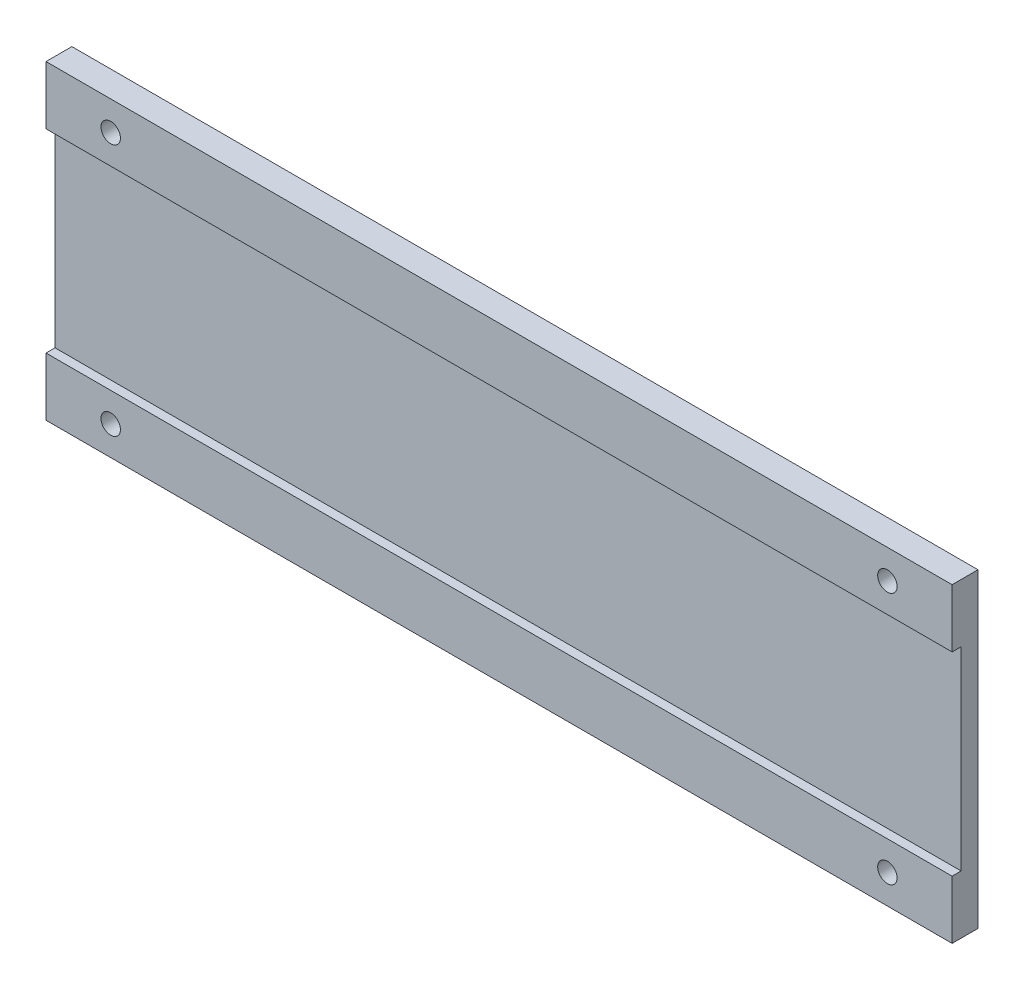
ISO-10303-21;
HEADER;
FILE_DESCRIPTION(('STEP AP214'),'2;1');
FILE_NAME('part.step','',(''),(''),'','','');
FILE_SCHEMA(('AUTOMOTIVE_DESIGN { 1 0 10303 214 1 1 1 1 }'));
ENDSEC;
DATA;
#1=APPLICATION_CONTEXT('core data for automotive mechanical design processes');
#2=APPLICATION_PROTOCOL_DEFINITION('international standard','automotive_design',2000,#1);
#3=PRODUCT_CONTEXT('',#1,'mechanical');
#4=PRODUCT('Part','Part','',(#3));
#5=PRODUCT_RELATED_PRODUCT_CATEGORY('part','',(#4));
#6=PRODUCT_DEFINITION_FORMATION('','',#4);
#7=PRODUCT_DEFINITION_CONTEXT('part definition',#1,'design');
#8=PRODUCT_DEFINITION('design','',#6,#7);
#9=PRODUCT_DEFINITION_SHAPE('','',#8);
#10=(LENGTH_UNIT() NAMED_UNIT(*) SI_UNIT(.MILLI.,.METRE.));
#11=(NAMED_UNIT(*) PLANE_ANGLE_UNIT() SI_UNIT($,.RADIAN.));
#12=(NAMED_UNIT(*) SI_UNIT($,.STERADIAN.) SOLID_ANGLE_UNIT());
#13=UNCERTAINTY_MEASURE_WITH_UNIT(LENGTH_MEASURE(1.E-05),#10,'distance_accuracy_value','');
#14=(GEOMETRIC_REPRESENTATION_CONTEXT(3) GLOBAL_UNCERTAINTY_ASSIGNED_CONTEXT((#13)) GLOBAL_UNIT_ASSIGNED_CONTEXT((#10,
#11,#12)) REPRESENTATION_CONTEXT('',''));
#15=CARTESIAN_POINT('',(0.,0.,0.));
#16=DIRECTION('',(0.,0.,1.));
#17=DIRECTION('',(1.,0.,0.));
#18=AXIS2_PLACEMENT_3D('',#15,#16,#17);
#19=CARTESIAN_POINT('',(0.,0.,4.));
#20=DIRECTION('',(0.,0.,1.));
#21=DIRECTION('',(1.,0.,0.));
#22=AXIS2_PLACEMENT_3D('',#19,#20,#21);
#23=PLANE('',#22);
#24=CARTESIAN_POINT('',(96.4410415455192,-17.5606060606061,4.));
#25=DIRECTION('',(0.,0.,1.));
#26=DIRECTION('',(1.,0.,0.));
#27=AXIS2_PLACEMENT_3D('',#24,#25,#26);
#28=CIRCLE('',#27,1.5);
#29=CARTESIAN_POINT('',(97.9410415455192,-17.5606060606061,4.));
#30=VERTEX_POINT('',#29);
#31=EDGE_CURVE('E186',#30,#30,#28,.T.);
#32=ORIENTED_EDGE('',*,*,#31,.F.);
#33=EDGE_LOOP('',(#32));
#34=FACE_BOUND('',#33,.T.);
#35=CARTESIAN_POINT('',(-23.5589584544808,-17.5606060606061,4.));
#36=DIRECTION('',(0.,0.,1.));
#37=DIRECTION('',(1.,0.,0.));
#38=AXIS2_PLACEMENT_3D('',#35,#36,#37);
#39=CIRCLE('',#38,1.5);
#40=CARTESIAN_POINT('',(-22.0589584544808,-17.5606060606061,4.));
#41=VERTEX_POINT('',#40);
#42=EDGE_CURVE('E177',#41,#41,#39,.T.);
#43=ORIENTED_EDGE('',*,*,#42,.F.);
#44=EDGE_LOOP('',(#43));
#45=FACE_BOUND('',#44,.T.);
#46=DIRECTION('',(-1.,0.,0.));
#47=VECTOR('',#46,1.);
#48=CARTESIAN_POINT('',(106.441041545519,-13.0606060606061,4.));
#49=LINE('',#48,#47);
#50=CARTESIAN_POINT('',(106.441041545519,-13.0606060606061,4.));
#51=VERTEX_POINT('',#50);
#52=CARTESIAN_POINT('',(-33.5589584544808,-13.0606060606061,4.));
#53=VERTEX_POINT('',#52);
#54=EDGE_CURVE('E144',#51,#53,#49,.T.);
#55=ORIENTED_EDGE('',*,*,#54,.T.);
#56=DIRECTION('',(0.,-1.,0.));
#57=VECTOR('',#56,1.);
#58=CARTESIAN_POINT('',(-33.5589584544808,25.9393939393939,4.));
#59=LINE('',#58,#57);
#60=CARTESIAN_POINT('',(-33.5589584544808,-22.0606060606061,4.));
#61=VERTEX_POINT('',#60);
#62=EDGE_CURVE('E88',#53,#61,#59,.T.);
#63=ORIENTED_EDGE('',*,*,#62,.T.);
#64=DIRECTION('',(1.,0.,0.));
#65=VECTOR('',#64,1.);
#66=CARTESIAN_POINT('',(-33.5589584544808,-22.0606060606061,4.));
#67=LINE('',#66,#65);
#68=CARTESIAN_POINT('',(106.441041545519,-22.0606060606061,4.));
#69=VERTEX_POINT('',#68);
#70=EDGE_CURVE('E151',#61,#69,#67,.T.);
#71=ORIENTED_EDGE('',*,*,#70,.T.);
#72=DIRECTION('',(0.,1.,0.));
#73=VECTOR('',#72,1.);
#74=CARTESIAN_POINT('',(106.441041545519,25.9393939393939,4.));
#75=LINE('',#74,#73);
#76=EDGE_CURVE('E153',#69,#51,#75,.T.);
#77=ORIENTED_EDGE('',*,*,#76,.T.);
#78=EDGE_LOOP('',(#55,#63,#71,#77));
#79=FACE_BOUND('',#78,.T.);
#80=ADVANCED_FACE('F33',(#34,#45,#79),#23,.T.);
#81=CARTESIAN_POINT('',(-33.5589584544808,25.9393939393939,4.));
#82=DIRECTION('',(1.,0.,0.));
#83=DIRECTION('',(0.,0.,-1.));
#84=AXIS2_PLACEMENT_3D('',#81,#82,#83);
#85=PLANE('',#84);
#86=ORIENTED_EDGE('',*,*,#62,.F.);
#87=DIRECTION('',(0.,0.,1.));
#88=VECTOR('',#87,1.);
#89=CARTESIAN_POINT('',(-33.5589584544808,-13.0606060606061,4.));
#90=LINE('',#89,#88);
#91=CARTESIAN_POINT('',(-33.5589584544808,-13.0606060606061,2.60987779067783));
#92=VERTEX_POINT('',#91);
#93=EDGE_CURVE('E132',#92,#53,#90,.T.);
#94=ORIENTED_EDGE('',*,*,#93,.F.);
#95=DIRECTION('',(0.,-1.,0.));
#96=VECTOR('',#95,1.);
#97=CARTESIAN_POINT('',(-33.5589584544808,16.9393939393939,2.60987779067783));
#98=LINE('',#97,#96);
#99=CARTESIAN_POINT('',(-33.5589584544808,16.9393939393939,2.60987779067783));
#100=VERTEX_POINT('',#99);
#101=EDGE_CURVE('E134',#100,#92,#98,.T.);
#102=ORIENTED_EDGE('',*,*,#101,.F.);
#103=DIRECTION('',(0.,0.,-1.));
#104=VECTOR('',#103,1.);
#105=CARTESIAN_POINT('',(-33.5589584544808,16.9393939393939,4.));
#106=LINE('',#105,#104);
#107=CARTESIAN_POINT('',(-33.5589584544808,16.9393939393939,4.));
#108=VERTEX_POINT('',#107);
#109=EDGE_CURVE('E113',#108,#100,#106,.T.);
#110=ORIENTED_EDGE('',*,*,#109,.F.);
#111=CARTESIAN_POINT('',(-33.5589584544808,25.9393939393939,4.));
#112=VERTEX_POINT('',#111);
#113=EDGE_CURVE('E149',#112,#108,#59,.T.);
#114=ORIENTED_EDGE('',*,*,#113,.F.);
#115=DIRECTION('',(0.,0.,-1.));
#116=VECTOR('',#115,1.);
#117=CARTESIAN_POINT('',(-33.5589584544808,25.9393939393939,4.));
#118=LINE('',#117,#116);
#119=CARTESIAN_POINT('',(-33.5589584544808,25.9393939393939,0.));
#120=VERTEX_POINT('',#119);
#121=EDGE_CURVE('E157',#112,#120,#118,.T.);
#122=ORIENTED_EDGE('',*,*,#121,.T.);
#123=DIRECTION('',(0.,-1.,0.));
#124=VECTOR('',#123,1.);
#125=CARTESIAN_POINT('',(-33.5589584544808,25.9393939393939,0.));
#126=LINE('',#125,#124);
#127=CARTESIAN_POINT('',(-33.5589584544808,-22.0606060606061,0.));
#128=VERTEX_POINT('',#127);
#129=EDGE_CURVE('E146',#120,#128,#126,.T.);
#130=ORIENTED_EDGE('',*,*,#129,.T.);
#131=DIRECTION('',(0.,0.,-1.));
#132=VECTOR('',#131,1.);
#133=CARTESIAN_POINT('',(-33.5589584544808,-22.0606060606061,4.));
#134=LINE('',#133,#132);
#135=EDGE_CURVE('E11',#61,#128,#134,.T.);
#136=ORIENTED_EDGE('',*,*,#135,.F.);
#137=EDGE_LOOP('',(#86,#94,#102,#110,#114,#122,#130,#136));
#138=FACE_BOUND('',#137,.T.);
#139=ADVANCED_FACE('F35',(#138),#85,.F.);
#140=CARTESIAN_POINT('',(-33.5589584544808,-22.0606060606061,4.));
#141=DIRECTION('',(0.,1.,0.));
#142=DIRECTION('',(-1.,0.,0.));
#143=AXIS2_PLACEMENT_3D('',#140,#141,#142);
#144=PLANE('',#143);
#145=DIRECTION('',(1.,0.,0.));
#146=VECTOR('',#145,1.);
#147=CARTESIAN_POINT('',(-33.5589584544808,-22.0606060606061,0.));
#148=LINE('',#147,#146);
#149=CARTESIAN_POINT('',(106.441041545519,-22.0606060606061,0.));
#150=VERTEX_POINT('',#149);
#151=EDGE_CURVE('E160',#128,#150,#148,.T.);
#152=ORIENTED_EDGE('',*,*,#151,.T.);
#153=DIRECTION('',(0.,0.,-1.));
#154=VECTOR('',#153,1.);
#155=CARTESIAN_POINT('',(106.441041545519,-22.0606060606061,4.));
#156=LINE('',#155,#154);
#157=EDGE_CURVE('E42',#69,#150,#156,.T.);
#158=ORIENTED_EDGE('',*,*,#157,.F.);
#159=ORIENTED_EDGE('',*,*,#70,.F.);
#160=ORIENTED_EDGE('',*,*,#135,.T.);
#161=EDGE_LOOP('',(#152,#158,#159,#160));
#162=FACE_BOUND('',#161,.T.);
#163=ADVANCED_FACE('F205',(#162),#144,.F.);
#164=CARTESIAN_POINT('',(106.441041545519,25.9393939393939,4.));
#165=DIRECTION('',(-1.,0.,0.));
#166=DIRECTION('',(0.,0.,1.));
#167=AXIS2_PLACEMENT_3D('',#164,#165,#166);
#168=PLANE('',#167);
#169=DIRECTION('',(0.,-1.,0.));
#170=VECTOR('',#169,1.);
#171=CARTESIAN_POINT('',(106.441041545519,16.9393939393939,2.60987779067783));
#172=LINE('',#171,#170);
#173=CARTESIAN_POINT('',(106.441041545519,16.9393939393939,2.60987779067783));
#174=VERTEX_POINT('',#173);
#175=CARTESIAN_POINT('',(106.441041545519,-13.0606060606061,2.60987779067783));
#176=VERTEX_POINT('',#175);
#177=EDGE_CURVE('E121',#174,#176,#172,.T.);
#178=ORIENTED_EDGE('',*,*,#177,.T.);
#179=DIRECTION('',(0.,0.,1.));
#180=VECTOR('',#179,1.);
#181=CARTESIAN_POINT('',(106.441041545519,-13.0606060606061,4.));
#182=LINE('',#181,#180);
#183=EDGE_CURVE('E126',#176,#51,#182,.T.);
#184=ORIENTED_EDGE('',*,*,#183,.T.);
#185=ORIENTED_EDGE('',*,*,#76,.F.);
#186=ORIENTED_EDGE('',*,*,#157,.T.);
#187=DIRECTION('',(0.,1.,0.));
#188=VECTOR('',#187,1.);
#189=CARTESIAN_POINT('',(106.441041545519,25.9393939393939,0.));
#190=LINE('',#189,#188);
#191=CARTESIAN_POINT('',(106.441041545519,25.9393939393939,0.));
#192=VERTEX_POINT('',#191);
#193=EDGE_CURVE('E162',#150,#192,#190,.T.);
#194=ORIENTED_EDGE('',*,*,#193,.T.);
#195=DIRECTION('',(0.,0.,-1.));
#196=VECTOR('',#195,1.);
#197=CARTESIAN_POINT('',(106.441041545519,25.9393939393939,4.));
#198=LINE('',#197,#196);
#199=CARTESIAN_POINT('',(106.441041545519,25.9393939393939,4.));
#200=VERTEX_POINT('',#199);
#201=EDGE_CURVE('E166',#200,#192,#198,.T.);
#202=ORIENTED_EDGE('',*,*,#201,.F.);
#203=CARTESIAN_POINT('',(106.441041545519,16.9393939393939,4.));
#204=VERTEX_POINT('',#203);
#205=EDGE_CURVE('E131',#204,#200,#75,.T.);
#206=ORIENTED_EDGE('',*,*,#205,.F.);
#207=DIRECTION('',(0.,0.,-1.));
#208=VECTOR('',#207,1.);
#209=CARTESIAN_POINT('',(106.441041545519,16.9393939393939,4.));
#210=LINE('',#209,#208);
#211=EDGE_CURVE('E50',#204,#174,#210,.T.);
#212=ORIENTED_EDGE('',*,*,#211,.T.);
#213=EDGE_LOOP('',(#178,#184,#185,#186,#194,#202,#206,#212));
#214=FACE_BOUND('',#213,.T.);
#215=ADVANCED_FACE('F129',(#214),#168,.F.);
#216=CARTESIAN_POINT('',(-33.5589584544808,25.9393939393939,4.));
#217=DIRECTION('',(0.,-1.,0.));
#218=DIRECTION('',(0.,0.,-1.));
#219=AXIS2_PLACEMENT_3D('',#216,#217,#218);
#220=PLANE('',#219);
#221=DIRECTION('',(-1.,0.,0.));
#222=VECTOR('',#221,1.);
#223=CARTESIAN_POINT('',(-33.5589584544808,25.9393939393939,0.));
#224=LINE('',#223,#222);
#225=EDGE_CURVE('E80',#192,#120,#224,.T.);
#226=ORIENTED_EDGE('',*,*,#225,.T.);
#227=ORIENTED_EDGE('',*,*,#121,.F.);
#228=DIRECTION('',(-1.,0.,0.));
#229=VECTOR('',#228,1.);
#230=CARTESIAN_POINT('',(-33.5589584544808,25.9393939393939,4.));
#231=LINE('',#230,#229);
#232=EDGE_CURVE('E59',#200,#112,#231,.T.);
#233=ORIENTED_EDGE('',*,*,#232,.F.);
#234=ORIENTED_EDGE('',*,*,#201,.T.);
#235=EDGE_LOOP('',(#226,#227,#233,#234));
#236=FACE_BOUND('',#235,.T.);
#237=ADVANCED_FACE('F210',(#236),#220,.F.);
#238=CARTESIAN_POINT('',(96.4410415455192,21.4393939393939,4.));
#239=DIRECTION('',(0.,0.,1.));
#240=DIRECTION('',(1.,0.,0.));
#241=AXIS2_PLACEMENT_3D('',#238,#239,#240);
#242=CIRCLE('',#241,1.5);
#243=CARTESIAN_POINT('',(97.9410415455192,21.4393939393939,4.));
#244=VERTEX_POINT('',#243);
#245=EDGE_CURVE('E174',#244,#244,#242,.T.);
#246=ORIENTED_EDGE('',*,*,#245,.F.);
#247=EDGE_LOOP('',(#246));
#248=FACE_BOUND('',#247,.T.);
#249=CARTESIAN_POINT('',(-23.5589584544808,21.4393939393939,4.));
#250=DIRECTION('',(0.,0.,1.));
#251=DIRECTION('',(1.,0.,0.));
#252=AXIS2_PLACEMENT_3D('',#249,#250,#251);
#253=CIRCLE('',#252,1.5);
#254=CARTESIAN_POINT('',(-22.0589584544808,21.4393939393939,4.));
#255=VERTEX_POINT('',#254);
#256=EDGE_CURVE('E137',#255,#255,#253,.T.);
#257=ORIENTED_EDGE('',*,*,#256,.F.);
#258=EDGE_LOOP('',(#257));
#259=FACE_BOUND('',#258,.T.);
#260=DIRECTION('',(-1.,0.,0.));
#261=VECTOR('',#260,1.);
#262=CARTESIAN_POINT('',(106.441041545519,16.9393939393939,4.));
#263=LINE('',#262,#261);
#264=EDGE_CURVE('E118',#204,#108,#263,.T.);
#265=ORIENTED_EDGE('',*,*,#264,.F.);
#266=ORIENTED_EDGE('',*,*,#205,.T.);
#267=ORIENTED_EDGE('',*,*,#232,.T.);
#268=ORIENTED_EDGE('',*,*,#113,.T.);
#269=EDGE_LOOP('',(#265,#266,#267,#268));
#270=FACE_BOUND('',#269,.T.);
#271=ADVANCED_FACE('F197',(#248,#259,#270),#23,.T.);
#272=CARTESIAN_POINT('',(0.,0.,0.));
#273=DIRECTION('',(0.,0.,1.));
#274=DIRECTION('',(1.,0.,0.));
#275=AXIS2_PLACEMENT_3D('',#272,#273,#274);
#276=PLANE('',#275);
#277=CARTESIAN_POINT('',(96.4410415455192,-17.5606060606061,0.));
#278=DIRECTION('',(0.,0.,1.));
#279=DIRECTION('',(1.,0.,0.));
#280=AXIS2_PLACEMENT_3D('',#277,#278,#279);
#281=CIRCLE('',#280,1.5);
#282=CARTESIAN_POINT('',(97.9410415455192,-17.5606060606061,0.));
#283=VERTEX_POINT('',#282);
#284=EDGE_CURVE('E37',#283,#283,#281,.T.);
#285=ORIENTED_EDGE('',*,*,#284,.T.);
#286=EDGE_LOOP('',(#285));
#287=FACE_BOUND('',#286,.T.);
#288=CARTESIAN_POINT('',(-23.5589584544808,-17.5606060606061,0.));
#289=DIRECTION('',(0.,0.,1.));
#290=DIRECTION('',(1.,0.,0.));
#291=AXIS2_PLACEMENT_3D('',#288,#289,#290);
#292=CIRCLE('',#291,1.5);
#293=CARTESIAN_POINT('',(-22.0589584544808,-17.5606060606061,0.));
#294=VERTEX_POINT('',#293);
#295=EDGE_CURVE('E175',#294,#294,#292,.T.);
#296=ORIENTED_EDGE('',*,*,#295,.T.);
#297=EDGE_LOOP('',(#296));
#298=FACE_BOUND('',#297,.T.);
#299=CARTESIAN_POINT('',(96.4410415455192,21.4393939393939,0.));
#300=DIRECTION('',(0.,0.,1.));
#301=DIRECTION('',(1.,0.,0.));
#302=AXIS2_PLACEMENT_3D('',#299,#300,#301);
#303=CIRCLE('',#302,1.5);
#304=CARTESIAN_POINT('',(97.9410415455192,21.4393939393939,0.));
#305=VERTEX_POINT('',#304);
#306=EDGE_CURVE('E172',#305,#305,#303,.T.);
#307=ORIENTED_EDGE('',*,*,#306,.T.);
#308=EDGE_LOOP('',(#307));
#309=FACE_BOUND('',#308,.T.);
#310=CARTESIAN_POINT('',(-23.5589584544808,21.4393939393939,0.));
#311=DIRECTION('',(0.,0.,1.));
#312=DIRECTION('',(1.,0.,0.));
#313=AXIS2_PLACEMENT_3D('',#310,#311,#312);
#314=CIRCLE('',#313,1.5);
#315=CARTESIAN_POINT('',(-22.0589584544808,21.4393939393939,0.));
#316=VERTEX_POINT('',#315);
#317=EDGE_CURVE('E142',#316,#316,#314,.T.);
#318=ORIENTED_EDGE('',*,*,#317,.T.);
#319=EDGE_LOOP('',(#318));
#320=FACE_BOUND('',#319,.T.);
#321=ORIENTED_EDGE('',*,*,#129,.F.);
#322=ORIENTED_EDGE('',*,*,#225,.F.);
#323=ORIENTED_EDGE('',*,*,#193,.F.);
#324=ORIENTED_EDGE('',*,*,#151,.F.);
#325=EDGE_LOOP('',(#321,#322,#323,#324));
#326=FACE_BOUND('',#325,.T.);
#327=ADVANCED_FACE('F212',(#287,#298,#309,#320,#326),#276,.F.);
#328=CARTESIAN_POINT('',(106.441041545519,-13.0606060606061,4.));
#329=DIRECTION('',(0.,-1.,0.));
#330=DIRECTION('',(0.,0.,-1.));
#331=AXIS2_PLACEMENT_3D('',#328,#329,#330);
#332=PLANE('',#331);
#333=ORIENTED_EDGE('',*,*,#93,.T.);
#334=ORIENTED_EDGE('',*,*,#54,.F.);
#335=ORIENTED_EDGE('',*,*,#183,.F.);
#336=DIRECTION('',(-1.,0.,0.));
#337=VECTOR('',#336,1.);
#338=CARTESIAN_POINT('',(106.441041545519,-13.0606060606061,2.60987779067783));
#339=LINE('',#338,#337);
#340=EDGE_CURVE('E117',#176,#92,#339,.T.);
#341=ORIENTED_EDGE('',*,*,#340,.T.);
#342=EDGE_LOOP('',(#333,#334,#335,#341));
#343=FACE_BOUND('',#342,.T.);
#344=ADVANCED_FACE('F208',(#343),#332,.F.);
#345=CARTESIAN_POINT('',(106.441041545519,16.9393939393939,2.60987779067783));
#346=DIRECTION('',(0.,0.,-1.));
#347=DIRECTION('',(0.,1.,0.));
#348=AXIS2_PLACEMENT_3D('',#345,#346,#347);
#349=PLANE('',#348);
#350=ORIENTED_EDGE('',*,*,#101,.T.);
#351=ORIENTED_EDGE('',*,*,#340,.F.);
#352=ORIENTED_EDGE('',*,*,#177,.F.);
#353=DIRECTION('',(-1.,0.,0.));
#354=VECTOR('',#353,1.);
#355=CARTESIAN_POINT('',(106.441041545519,16.9393939393939,2.60987779067783));
#356=LINE('',#355,#354);
#357=EDGE_CURVE('E109',#174,#100,#356,.T.);
#358=ORIENTED_EDGE('',*,*,#357,.T.);
#359=EDGE_LOOP('',(#350,#351,#352,#358));
#360=FACE_BOUND('',#359,.T.);
#361=ADVANCED_FACE('F122',(#360),#349,.F.);
#362=CARTESIAN_POINT('',(106.441041545519,16.9393939393939,4.));
#363=DIRECTION('',(0.,1.,0.));
#364=DIRECTION('',(0.,0.,1.));
#365=AXIS2_PLACEMENT_3D('',#362,#363,#364);
#366=PLANE('',#365);
#367=ORIENTED_EDGE('',*,*,#109,.T.);
#368=ORIENTED_EDGE('',*,*,#357,.F.);
#369=ORIENTED_EDGE('',*,*,#211,.F.);
#370=ORIENTED_EDGE('',*,*,#264,.T.);
#371=EDGE_LOOP('',(#367,#368,#369,#370));
#372=FACE_BOUND('',#371,.T.);
#373=ADVANCED_FACE('F111',(#372),#366,.F.);
#374=CARTESIAN_POINT('',(-23.5589584544808,21.4393939393939,-2.));
#375=DIRECTION('',(0.,0.,1.));
#376=DIRECTION('',(1.,0.,0.));
#377=AXIS2_PLACEMENT_3D('',#374,#375,#376);
#378=CYLINDRICAL_SURFACE('',#377,1.5);
#379=ORIENTED_EDGE('',*,*,#256,.T.);
#380=EDGE_LOOP('',(#379));
#381=FACE_BOUND('',#380,.T.);
#382=ORIENTED_EDGE('',*,*,#317,.F.);
#383=EDGE_LOOP('',(#382));
#384=FACE_BOUND('',#383,.T.);
#385=ADVANCED_FACE('F261',(#381,#384),#378,.F.);
#386=CARTESIAN_POINT('',(96.4410415455192,21.4393939393939,-2.));
#387=DIRECTION('',(0.,0.,1.));
#388=DIRECTION('',(1.,0.,0.));
#389=AXIS2_PLACEMENT_3D('',#386,#387,#388);
#390=CYLINDRICAL_SURFACE('',#389,1.5);
#391=ORIENTED_EDGE('',*,*,#245,.T.);
#392=EDGE_LOOP('',(#391));
#393=FACE_BOUND('',#392,.T.);
#394=ORIENTED_EDGE('',*,*,#306,.F.);
#395=EDGE_LOOP('',(#394));
#396=FACE_BOUND('',#395,.T.);
#397=ADVANCED_FACE('F266',(#393,#396),#390,.F.);
#398=CARTESIAN_POINT('',(-23.5589584544808,-17.5606060606061,-2.));
#399=DIRECTION('',(0.,0.,1.));
#400=DIRECTION('',(1.,0.,0.));
#401=AXIS2_PLACEMENT_3D('',#398,#399,#400);
#402=CYLINDRICAL_SURFACE('',#401,1.5);
#403=ORIENTED_EDGE('',*,*,#42,.T.);
#404=EDGE_LOOP('',(#403));
#405=FACE_BOUND('',#404,.T.);
#406=ORIENTED_EDGE('',*,*,#295,.F.);
#407=EDGE_LOOP('',(#406));
#408=FACE_BOUND('',#407,.T.);
#409=ADVANCED_FACE('F276',(#405,#408),#402,.F.);
#410=CARTESIAN_POINT('',(96.4410415455192,-17.5606060606061,-2.));
#411=DIRECTION('',(0.,0.,1.));
#412=DIRECTION('',(1.,0.,0.));
#413=AXIS2_PLACEMENT_3D('',#410,#411,#412);
#414=CYLINDRICAL_SURFACE('',#413,1.5);
#415=ORIENTED_EDGE('',*,*,#31,.T.);
#416=EDGE_LOOP('',(#415));
#417=FACE_BOUND('',#416,.T.);
#418=ORIENTED_EDGE('',*,*,#284,.F.);
#419=EDGE_LOOP('',(#418));
#420=FACE_BOUND('',#419,.T.);
#421=ADVANCED_FACE('F191',(#417,#420),#414,.F.);
#422=CLOSED_SHELL('',(#80,#139,#163,#215,#237,#271,#327,#344,#361,#373,#385,#397,#409,#421));
#423=MANIFOLD_SOLID_BREP('B2',#422);
#424=ADVANCED_BREP_SHAPE_REPRESENTATION('',(#18,#423),#14);
#425=SHAPE_DEFINITION_REPRESENTATION(#9,#424);
ENDSEC;
END-ISO-10303-21;
